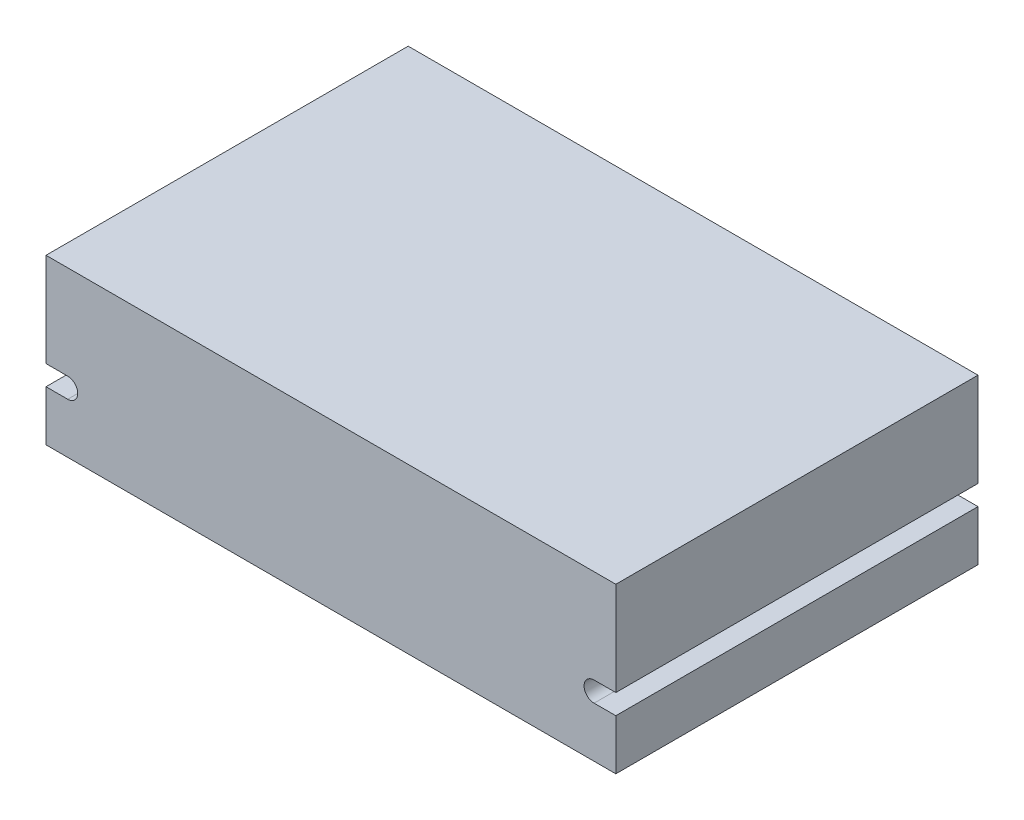
ISO-10303-21;
HEADER;
FILE_DESCRIPTION(('STEP AP214'),'2;1');
FILE_NAME('part.step','',(''),(''),'','','');
FILE_SCHEMA(('AUTOMOTIVE_DESIGN { 1 0 10303 214 1 1 1 1 }'));
ENDSEC;
DATA;
#1=APPLICATION_CONTEXT('core data for automotive mechanical design processes');
#2=APPLICATION_PROTOCOL_DEFINITION('international standard','automotive_design',2000,#1);
#3=PRODUCT_CONTEXT('',#1,'mechanical');
#4=PRODUCT('Part','Part','',(#3));
#5=PRODUCT_RELATED_PRODUCT_CATEGORY('part','',(#4));
#6=PRODUCT_DEFINITION_FORMATION('','',#4);
#7=PRODUCT_DEFINITION_CONTEXT('part definition',#1,'design');
#8=PRODUCT_DEFINITION('design','',#6,#7);
#9=PRODUCT_DEFINITION_SHAPE('','',#8);
#10=(LENGTH_UNIT() NAMED_UNIT(*) SI_UNIT(.MILLI.,.METRE.));
#11=(NAMED_UNIT(*) PLANE_ANGLE_UNIT() SI_UNIT($,.RADIAN.));
#12=(NAMED_UNIT(*) SI_UNIT($,.STERADIAN.) SOLID_ANGLE_UNIT());
#13=UNCERTAINTY_MEASURE_WITH_UNIT(LENGTH_MEASURE(1.E-05),#10,'distance_accuracy_value','');
#14=(GEOMETRIC_REPRESENTATION_CONTEXT(3) GLOBAL_UNCERTAINTY_ASSIGNED_CONTEXT((#13)) GLOBAL_UNIT_ASSIGNED_CONTEXT((#10,
#11,#12)) REPRESENTATION_CONTEXT('',''));
#15=CARTESIAN_POINT('',(0.,0.,0.));
#16=DIRECTION('',(0.,0.,1.));
#17=DIRECTION('',(1.,0.,0.));
#18=AXIS2_PLACEMENT_3D('',#15,#16,#17);
#19=CARTESIAN_POINT('',(-56.75,17.,75.));
#20=DIRECTION('',(1.,0.,0.));
#21=DIRECTION('',(0.,0.,-1.));
#22=AXIS2_PLACEMENT_3D('',#19,#20,#21);
#23=PLANE('',#22);
#24=DIRECTION('',(0.,-1.,0.));
#25=VECTOR('',#24,1.);
#26=CARTESIAN_POINT('',(-56.75,17.,0.));
#27=LINE('',#26,#25);
#28=CARTESIAN_POINT('',(-56.75,17.,0.));
#29=VERTEX_POINT('',#28);
#30=CARTESIAN_POINT('',(-56.75,-2.42677328176177,0.));
#31=VERTEX_POINT('',#30);
#32=EDGE_CURVE('E153',#29,#31,#27,.T.);
#33=ORIENTED_EDGE('',*,*,#32,.T.);
#34=DIRECTION('',(0.,0.,-1.));
#35=VECTOR('',#34,1.);
#36=CARTESIAN_POINT('',(-56.75,-2.42677328176177,75.));
#37=LINE('',#36,#35);
#38=CARTESIAN_POINT('',(-56.75,-2.42677328176177,75.));
#39=VERTEX_POINT('',#38);
#40=EDGE_CURVE('E11',#39,#31,#37,.T.);
#41=ORIENTED_EDGE('',*,*,#40,.F.);
#42=DIRECTION('',(0.,-1.,0.));
#43=VECTOR('',#42,1.);
#44=CARTESIAN_POINT('',(-56.75,17.,75.));
#45=LINE('',#44,#43);
#46=CARTESIAN_POINT('',(-56.75,17.,75.));
#47=VERTEX_POINT('',#46);
#48=EDGE_CURVE('E175',#47,#39,#45,.T.);
#49=ORIENTED_EDGE('',*,*,#48,.F.);
#50=DIRECTION('',(0.,0.,-1.));
#51=VECTOR('',#50,1.);
#52=CARTESIAN_POINT('',(-56.75,17.,75.));
#53=LINE('',#52,#51);
#54=EDGE_CURVE('E149',#47,#29,#53,.T.);
#55=ORIENTED_EDGE('',*,*,#54,.T.);
#56=EDGE_LOOP('',(#33,#41,#49,#55));
#57=FACE_BOUND('',#56,.T.);
#58=ADVANCED_FACE('F33',(#57),#23,.F.);
#59=CARTESIAN_POINT('',(-56.75,-2.42677328176177,75.));
#60=DIRECTION('',(0.,1.,0.));
#61=DIRECTION('',(0.,0.,1.));
#62=AXIS2_PLACEMENT_3D('',#59,#60,#61);
#63=PLANE('',#62);
#64=DIRECTION('',(1.,0.,0.));
#65=VECTOR('',#64,1.);
#66=CARTESIAN_POINT('',(-56.75,-2.42677328176177,0.));
#67=LINE('',#66,#65);
#68=CARTESIAN_POINT('',(-52.25,-2.42677328176177,0.));
#69=VERTEX_POINT('',#68);
#70=EDGE_CURVE('E156',#31,#69,#67,.T.);
#71=ORIENTED_EDGE('',*,*,#70,.T.);
#72=DIRECTION('',(0.,0.,-1.));
#73=VECTOR('',#72,1.);
#74=CARTESIAN_POINT('',(-52.25,-2.42677328176177,75.));
#75=LINE('',#74,#73);
#76=CARTESIAN_POINT('',(-52.25,-2.42677328176177,75.));
#77=VERTEX_POINT('',#76);
#78=EDGE_CURVE('E41',#77,#69,#75,.T.);
#79=ORIENTED_EDGE('',*,*,#78,.F.);
#80=DIRECTION('',(1.,0.,0.));
#81=VECTOR('',#80,1.);
#82=CARTESIAN_POINT('',(-56.75,-2.42677328176177,75.));
#83=LINE('',#82,#81);
#84=EDGE_CURVE('E104',#39,#77,#83,.T.);
#85=ORIENTED_EDGE('',*,*,#84,.F.);
#86=ORIENTED_EDGE('',*,*,#40,.T.);
#87=EDGE_LOOP('',(#71,#79,#85,#86));
#88=FACE_BOUND('',#87,.T.);
#89=ADVANCED_FACE('F253',(#88),#63,.F.);
#90=CARTESIAN_POINT('',(-52.25,-4.49999999999995,75.));
#91=DIRECTION('',(0.,0.,-1.));
#92=DIRECTION('',(-1.,0.,0.));
#93=AXIS2_PLACEMENT_3D('',#90,#91,#92);
#94=CYLINDRICAL_SURFACE('',#93,2.07322671823817);
#95=CARTESIAN_POINT('',(-52.25,-4.49999999999995,0.));
#96=DIRECTION('',(0.,0.,-1.));
#97=DIRECTION('',(1.,0.,0.));
#98=AXIS2_PLACEMENT_3D('',#95,#96,#97);
#99=CIRCLE('',#98,2.07322671823817);
#100=CARTESIAN_POINT('',(-52.25,-6.57322671823812,0.));
#101=VERTEX_POINT('',#100);
#102=EDGE_CURVE('E158',#69,#101,#99,.T.);
#103=ORIENTED_EDGE('',*,*,#102,.T.);
#104=DIRECTION('',(0.,0.,-1.));
#105=VECTOR('',#104,1.);
#106=CARTESIAN_POINT('',(-52.25,-6.57322671823812,75.));
#107=LINE('',#106,#105);
#108=CARTESIAN_POINT('',(-52.25,-6.57322671823812,75.));
#109=VERTEX_POINT('',#108);
#110=EDGE_CURVE('E194',#109,#101,#107,.T.);
#111=ORIENTED_EDGE('',*,*,#110,.F.);
#112=CARTESIAN_POINT('',(-52.25,-4.49999999999995,75.));
#113=DIRECTION('',(0.,0.,-1.));
#114=DIRECTION('',(1.,0.,0.));
#115=AXIS2_PLACEMENT_3D('',#112,#113,#114);
#116=CIRCLE('',#115,2.07322671823817);
#117=EDGE_CURVE('E202',#77,#109,#116,.T.);
#118=ORIENTED_EDGE('',*,*,#117,.F.);
#119=ORIENTED_EDGE('',*,*,#78,.T.);
#120=EDGE_LOOP('',(#103,#111,#118,#119));
#121=FACE_BOUND('',#120,.T.);
#122=ADVANCED_FACE('F200',(#121),#94,.F.);
#123=CARTESIAN_POINT('',(-56.75,-6.57322671823812,75.));
#124=DIRECTION('',(0.,-1.,0.));
#125=DIRECTION('',(0.,0.,-1.));
#126=AXIS2_PLACEMENT_3D('',#123,#124,#125);
#127=PLANE('',#126);
#128=DIRECTION('',(-1.,0.,0.));
#129=VECTOR('',#128,1.);
#130=CARTESIAN_POINT('',(-56.75,-6.57322671823812,0.));
#131=LINE('',#130,#129);
#132=CARTESIAN_POINT('',(-56.75,-6.57322671823812,0.));
#133=VERTEX_POINT('',#132);
#134=EDGE_CURVE('E160',#101,#133,#131,.T.);
#135=ORIENTED_EDGE('',*,*,#134,.T.);
#136=DIRECTION('',(0.,0.,-1.));
#137=VECTOR('',#136,1.);
#138=CARTESIAN_POINT('',(-56.75,-6.57322671823812,75.));
#139=LINE('',#138,#137);
#140=CARTESIAN_POINT('',(-56.75,-6.57322671823812,75.));
#141=VERTEX_POINT('',#140);
#142=EDGE_CURVE('E191',#141,#133,#139,.T.);
#143=ORIENTED_EDGE('',*,*,#142,.F.);
#144=DIRECTION('',(-1.,0.,0.));
#145=VECTOR('',#144,1.);
#146=CARTESIAN_POINT('',(-56.75,-6.57322671823812,75.));
#147=LINE('',#146,#145);
#148=EDGE_CURVE('E220',#109,#141,#147,.T.);
#149=ORIENTED_EDGE('',*,*,#148,.F.);
#150=ORIENTED_EDGE('',*,*,#110,.T.);
#151=EDGE_LOOP('',(#135,#143,#149,#150));
#152=FACE_BOUND('',#151,.T.);
#153=ADVANCED_FACE('F211',(#152),#127,.F.);
#154=CARTESIAN_POINT('',(-56.75,-6.57322671823812,75.));
#155=DIRECTION('',(1.,0.,0.));
#156=DIRECTION('',(0.,0.,-1.));
#157=AXIS2_PLACEMENT_3D('',#154,#155,#156);
#158=PLANE('',#157);
#159=DIRECTION('',(0.,-1.,0.));
#160=VECTOR('',#159,1.);
#161=CARTESIAN_POINT('',(-56.75,-6.57322671823812,0.));
#162=LINE('',#161,#160);
#163=CARTESIAN_POINT('',(-56.75,-17.,0.));
#164=VERTEX_POINT('',#163);
#165=EDGE_CURVE('E162',#133,#164,#162,.T.);
#166=ORIENTED_EDGE('',*,*,#165,.T.);
#167=DIRECTION('',(0.,0.,-1.));
#168=VECTOR('',#167,1.);
#169=CARTESIAN_POINT('',(-56.75,-17.,75.));
#170=LINE('',#169,#168);
#171=CARTESIAN_POINT('',(-56.75,-17.,75.));
#172=VERTEX_POINT('',#171);
#173=EDGE_CURVE('E188',#172,#164,#170,.T.);
#174=ORIENTED_EDGE('',*,*,#173,.F.);
#175=DIRECTION('',(0.,-1.,0.));
#176=VECTOR('',#175,1.);
#177=CARTESIAN_POINT('',(-56.75,-6.57322671823812,75.));
#178=LINE('',#177,#176);
#179=EDGE_CURVE('E217',#141,#172,#178,.T.);
#180=ORIENTED_EDGE('',*,*,#179,.F.);
#181=ORIENTED_EDGE('',*,*,#142,.T.);
#182=EDGE_LOOP('',(#166,#174,#180,#181));
#183=FACE_BOUND('',#182,.T.);
#184=ADVANCED_FACE('F215',(#183),#158,.F.);
#185=CARTESIAN_POINT('',(-56.75,-17.,75.));
#186=DIRECTION('',(0.,1.,0.));
#187=DIRECTION('',(0.,0.,1.));
#188=AXIS2_PLACEMENT_3D('',#185,#186,#187);
#189=PLANE('',#188);
#190=DIRECTION('',(1.,0.,0.));
#191=VECTOR('',#190,1.);
#192=CARTESIAN_POINT('',(-56.75,-17.,0.));
#193=LINE('',#192,#191);
#194=CARTESIAN_POINT('',(61.25,-17.,0.));
#195=VERTEX_POINT('',#194);
#196=EDGE_CURVE('E164',#164,#195,#193,.T.);
#197=ORIENTED_EDGE('',*,*,#196,.T.);
#198=DIRECTION('',(0.,0.,-1.));
#199=VECTOR('',#198,1.);
#200=CARTESIAN_POINT('',(61.25,-17.,75.));
#201=LINE('',#200,#199);
#202=CARTESIAN_POINT('',(61.25,-17.,75.));
#203=VERTEX_POINT('',#202);
#204=EDGE_CURVE('E185',#203,#195,#201,.T.);
#205=ORIENTED_EDGE('',*,*,#204,.F.);
#206=DIRECTION('',(1.,0.,0.));
#207=VECTOR('',#206,1.);
#208=CARTESIAN_POINT('',(-56.75,-17.,75.));
#209=LINE('',#208,#207);
#210=EDGE_CURVE('E219',#172,#203,#209,.T.);
#211=ORIENTED_EDGE('',*,*,#210,.F.);
#212=ORIENTED_EDGE('',*,*,#173,.T.);
#213=EDGE_LOOP('',(#197,#205,#211,#212));
#214=FACE_BOUND('',#213,.T.);
#215=ADVANCED_FACE('F266',(#214),#189,.F.);
#216=CARTESIAN_POINT('',(61.25,-6.57322671823812,75.));
#217=DIRECTION('',(-1.,0.,0.));
#218=DIRECTION('',(0.,0.,1.));
#219=AXIS2_PLACEMENT_3D('',#216,#217,#218);
#220=PLANE('',#219);
#221=DIRECTION('',(0.,1.,0.));
#222=VECTOR('',#221,1.);
#223=CARTESIAN_POINT('',(61.25,-6.57322671823812,0.));
#224=LINE('',#223,#222);
#225=CARTESIAN_POINT('',(61.25,-6.57322671823812,0.));
#226=VERTEX_POINT('',#225);
#227=EDGE_CURVE('E166',#195,#226,#224,.T.);
#228=ORIENTED_EDGE('',*,*,#227,.T.);
#229=DIRECTION('',(0.,0.,-1.));
#230=VECTOR('',#229,1.);
#231=CARTESIAN_POINT('',(61.25,-6.57322671823812,75.));
#232=LINE('',#231,#230);
#233=CARTESIAN_POINT('',(61.25,-6.57322671823812,75.));
#234=VERTEX_POINT('',#233);
#235=EDGE_CURVE('E182',#234,#226,#232,.T.);
#236=ORIENTED_EDGE('',*,*,#235,.F.);
#237=DIRECTION('',(0.,1.,0.));
#238=VECTOR('',#237,1.);
#239=CARTESIAN_POINT('',(61.25,-6.57322671823812,75.));
#240=LINE('',#239,#238);
#241=EDGE_CURVE('E222',#203,#234,#240,.T.);
#242=ORIENTED_EDGE('',*,*,#241,.F.);
#243=ORIENTED_EDGE('',*,*,#204,.T.);
#244=EDGE_LOOP('',(#228,#236,#242,#243));
#245=FACE_BOUND('',#244,.T.);
#246=ADVANCED_FACE('F269',(#245),#220,.F.);
#247=CARTESIAN_POINT('',(61.25,-6.57322671823812,75.));
#248=DIRECTION('',(0.,-1.,0.));
#249=DIRECTION('',(0.,0.,-1.));
#250=AXIS2_PLACEMENT_3D('',#247,#248,#249);
#251=PLANE('',#250);
#252=DIRECTION('',(-1.,0.,0.));
#253=VECTOR('',#252,1.);
#254=CARTESIAN_POINT('',(61.25,-6.57322671823812,0.));
#255=LINE('',#254,#253);
#256=CARTESIAN_POINT('',(56.75,-6.57322671823812,0.));
#257=VERTEX_POINT('',#256);
#258=EDGE_CURVE('E168',#226,#257,#255,.T.);
#259=ORIENTED_EDGE('',*,*,#258,.T.);
#260=DIRECTION('',(0.,0.,-1.));
#261=VECTOR('',#260,1.);
#262=CARTESIAN_POINT('',(56.75,-6.57322671823812,75.));
#263=LINE('',#262,#261);
#264=CARTESIAN_POINT('',(56.75,-6.57322671823812,75.));
#265=VERTEX_POINT('',#264);
#266=EDGE_CURVE('E179',#265,#257,#263,.T.);
#267=ORIENTED_EDGE('',*,*,#266,.F.);
#268=DIRECTION('',(-1.,0.,0.));
#269=VECTOR('',#268,1.);
#270=CARTESIAN_POINT('',(61.25,-6.57322671823812,75.));
#271=LINE('',#270,#269);
#272=EDGE_CURVE('E228',#234,#265,#271,.T.);
#273=ORIENTED_EDGE('',*,*,#272,.F.);
#274=ORIENTED_EDGE('',*,*,#235,.T.);
#275=EDGE_LOOP('',(#259,#267,#273,#274));
#276=FACE_BOUND('',#275,.T.);
#277=ADVANCED_FACE('F234',(#276),#251,.F.);
#278=CARTESIAN_POINT('',(56.75,-4.49999999999995,75.));
#279=DIRECTION('',(0.,0.,-1.));
#280=DIRECTION('',(-1.,0.,0.));
#281=AXIS2_PLACEMENT_3D('',#278,#279,#280);
#282=CYLINDRICAL_SURFACE('',#281,2.07322671823817);
#283=CARTESIAN_POINT('',(56.75,-4.49999999999995,0.));
#284=DIRECTION('',(0.,0.,-1.));
#285=DIRECTION('',(-1.,0.,0.));
#286=AXIS2_PLACEMENT_3D('',#283,#284,#285);
#287=CIRCLE('',#286,2.07322671823817);
#288=CARTESIAN_POINT('',(56.75,-2.42677328176177,0.));
#289=VERTEX_POINT('',#288);
#290=EDGE_CURVE('E170',#257,#289,#287,.T.);
#291=ORIENTED_EDGE('',*,*,#290,.T.);
#292=DIRECTION('',(0.,0.,-1.));
#293=VECTOR('',#292,1.);
#294=CARTESIAN_POINT('',(56.75,-2.42677328176177,75.));
#295=LINE('',#294,#293);
#296=CARTESIAN_POINT('',(56.75,-2.42677328176177,75.));
#297=VERTEX_POINT('',#296);
#298=EDGE_CURVE('E144',#297,#289,#295,.T.);
#299=ORIENTED_EDGE('',*,*,#298,.F.);
#300=CARTESIAN_POINT('',(56.75,-4.49999999999995,75.));
#301=DIRECTION('',(0.,0.,-1.));
#302=DIRECTION('',(-1.,0.,0.));
#303=AXIS2_PLACEMENT_3D('',#300,#301,#302);
#304=CIRCLE('',#303,2.07322671823817);
#305=EDGE_CURVE('E135',#265,#297,#304,.T.);
#306=ORIENTED_EDGE('',*,*,#305,.F.);
#307=ORIENTED_EDGE('',*,*,#266,.T.);
#308=EDGE_LOOP('',(#291,#299,#306,#307));
#309=FACE_BOUND('',#308,.T.);
#310=ADVANCED_FACE('F238',(#309),#282,.F.);
#311=CARTESIAN_POINT('',(61.25,-2.42677328176177,75.));
#312=DIRECTION('',(0.,1.,0.));
#313=DIRECTION('',(0.,0.,1.));
#314=AXIS2_PLACEMENT_3D('',#311,#312,#313);
#315=PLANE('',#314);
#316=DIRECTION('',(1.,0.,0.));
#317=VECTOR('',#316,1.);
#318=CARTESIAN_POINT('',(61.25,-2.42677328176177,0.));
#319=LINE('',#318,#317);
#320=CARTESIAN_POINT('',(61.25,-2.42677328176177,0.));
#321=VERTEX_POINT('',#320);
#322=EDGE_CURVE('E143',#289,#321,#319,.T.);
#323=ORIENTED_EDGE('',*,*,#322,.T.);
#324=DIRECTION('',(0.,0.,-1.));
#325=VECTOR('',#324,1.);
#326=CARTESIAN_POINT('',(61.25,-2.42677328176177,75.));
#327=LINE('',#326,#325);
#328=CARTESIAN_POINT('',(61.25,-2.42677328176177,75.));
#329=VERTEX_POINT('',#328);
#330=EDGE_CURVE('E140',#329,#321,#327,.T.);
#331=ORIENTED_EDGE('',*,*,#330,.F.);
#332=DIRECTION('',(1.,0.,0.));
#333=VECTOR('',#332,1.);
#334=CARTESIAN_POINT('',(61.25,-2.42677328176177,75.));
#335=LINE('',#334,#333);
#336=EDGE_CURVE('E129',#297,#329,#335,.T.);
#337=ORIENTED_EDGE('',*,*,#336,.F.);
#338=ORIENTED_EDGE('',*,*,#298,.T.);
#339=EDGE_LOOP('',(#323,#331,#337,#338));
#340=FACE_BOUND('',#339,.T.);
#341=ADVANCED_FACE('F141',(#340),#315,.F.);
#342=CARTESIAN_POINT('',(61.25,17.,75.));
#343=DIRECTION('',(-1.,0.,0.));
#344=DIRECTION('',(0.,0.,1.));
#345=AXIS2_PLACEMENT_3D('',#342,#343,#344);
#346=PLANE('',#345);
#347=DIRECTION('',(0.,1.,0.));
#348=VECTOR('',#347,1.);
#349=CARTESIAN_POINT('',(61.25,17.,0.));
#350=LINE('',#349,#348);
#351=CARTESIAN_POINT('',(61.25,17.,0.));
#352=VERTEX_POINT('',#351);
#353=EDGE_CURVE('E90',#321,#352,#350,.T.);
#354=ORIENTED_EDGE('',*,*,#353,.T.);
#355=DIRECTION('',(0.,0.,-1.));
#356=VECTOR('',#355,1.);
#357=CARTESIAN_POINT('',(61.25,17.,75.));
#358=LINE('',#357,#356);
#359=CARTESIAN_POINT('',(61.25,17.,75.));
#360=VERTEX_POINT('',#359);
#361=EDGE_CURVE('E145',#360,#352,#358,.T.);
#362=ORIENTED_EDGE('',*,*,#361,.F.);
#363=DIRECTION('',(0.,1.,0.));
#364=VECTOR('',#363,1.);
#365=CARTESIAN_POINT('',(61.25,17.,75.));
#366=LINE('',#365,#364);
#367=EDGE_CURVE('E133',#329,#360,#366,.T.);
#368=ORIENTED_EDGE('',*,*,#367,.F.);
#369=ORIENTED_EDGE('',*,*,#330,.T.);
#370=EDGE_LOOP('',(#354,#362,#368,#369));
#371=FACE_BOUND('',#370,.T.);
#372=ADVANCED_FACE('F147',(#371),#346,.F.);
#373=CARTESIAN_POINT('',(-56.75,17.,75.));
#374=DIRECTION('',(0.,-1.,0.));
#375=DIRECTION('',(0.,0.,-1.));
#376=AXIS2_PLACEMENT_3D('',#373,#374,#375);
#377=PLANE('',#376);
#378=DIRECTION('',(-1.,0.,0.));
#379=VECTOR('',#378,1.);
#380=CARTESIAN_POINT('',(-56.75,17.,0.));
#381=LINE('',#380,#379);
#382=EDGE_CURVE('E96',#352,#29,#381,.T.);
#383=ORIENTED_EDGE('',*,*,#382,.T.);
#384=ORIENTED_EDGE('',*,*,#54,.F.);
#385=DIRECTION('',(-1.,0.,0.));
#386=VECTOR('',#385,1.);
#387=CARTESIAN_POINT('',(-56.75,17.,75.));
#388=LINE('',#387,#386);
#389=EDGE_CURVE('E49',#360,#47,#388,.T.);
#390=ORIENTED_EDGE('',*,*,#389,.F.);
#391=ORIENTED_EDGE('',*,*,#361,.T.);
#392=EDGE_LOOP('',(#383,#384,#390,#391));
#393=FACE_BOUND('',#392,.T.);
#394=ADVANCED_FACE('F242',(#393),#377,.F.);
#395=CARTESIAN_POINT('',(-52.25,-4.49999999999995,75.));
#396=DIRECTION('',(0.,0.,1.));
#397=DIRECTION('',(1.,0.,0.));
#398=AXIS2_PLACEMENT_3D('',#395,#396,#397);
#399=PLANE('',#398);
#400=ORIENTED_EDGE('',*,*,#48,.T.);
#401=ORIENTED_EDGE('',*,*,#84,.T.);
#402=ORIENTED_EDGE('',*,*,#117,.T.);
#403=ORIENTED_EDGE('',*,*,#148,.T.);
#404=ORIENTED_EDGE('',*,*,#179,.T.);
#405=ORIENTED_EDGE('',*,*,#210,.T.);
#406=ORIENTED_EDGE('',*,*,#241,.T.);
#407=ORIENTED_EDGE('',*,*,#272,.T.);
#408=ORIENTED_EDGE('',*,*,#305,.T.);
#409=ORIENTED_EDGE('',*,*,#336,.T.);
#410=ORIENTED_EDGE('',*,*,#367,.T.);
#411=ORIENTED_EDGE('',*,*,#389,.T.);
#412=EDGE_LOOP('',(#400,#401,#402,#403,#404,#405,#406,#407,#408,#409,#410,#411));
#413=FACE_BOUND('',#412,.T.);
#414=ADVANCED_FACE('F131',(#413),#399,.T.);
#415=CARTESIAN_POINT('',(-52.25,-4.49999999999995,0.));
#416=DIRECTION('',(0.,0.,1.));
#417=DIRECTION('',(1.,0.,0.));
#418=AXIS2_PLACEMENT_3D('',#415,#416,#417);
#419=PLANE('',#418);
#420=ORIENTED_EDGE('',*,*,#32,.F.);
#421=ORIENTED_EDGE('',*,*,#382,.F.);
#422=ORIENTED_EDGE('',*,*,#353,.F.);
#423=ORIENTED_EDGE('',*,*,#322,.F.);
#424=ORIENTED_EDGE('',*,*,#290,.F.);
#425=ORIENTED_EDGE('',*,*,#258,.F.);
#426=ORIENTED_EDGE('',*,*,#227,.F.);
#427=ORIENTED_EDGE('',*,*,#196,.F.);
#428=ORIENTED_EDGE('',*,*,#165,.F.);
#429=ORIENTED_EDGE('',*,*,#134,.F.);
#430=ORIENTED_EDGE('',*,*,#102,.F.);
#431=ORIENTED_EDGE('',*,*,#70,.F.);
#432=EDGE_LOOP('',(#420,#421,#422,#423,#424,#425,#426,#427,#428,#429,#430,#431));
#433=FACE_BOUND('',#432,.T.);
#434=ADVANCED_FACE('F206',(#433),#419,.F.);
#435=CLOSED_SHELL('',(#58,#89,#122,#153,#184,#215,#246,#277,#310,#341,#372,#394,#414,#434));
#436=MANIFOLD_SOLID_BREP('B2',#435);
#437=ADVANCED_BREP_SHAPE_REPRESENTATION('',(#18,#436),#14);
#438=SHAPE_DEFINITION_REPRESENTATION(#9,#437);
ENDSEC;
END-ISO-10303-21;
